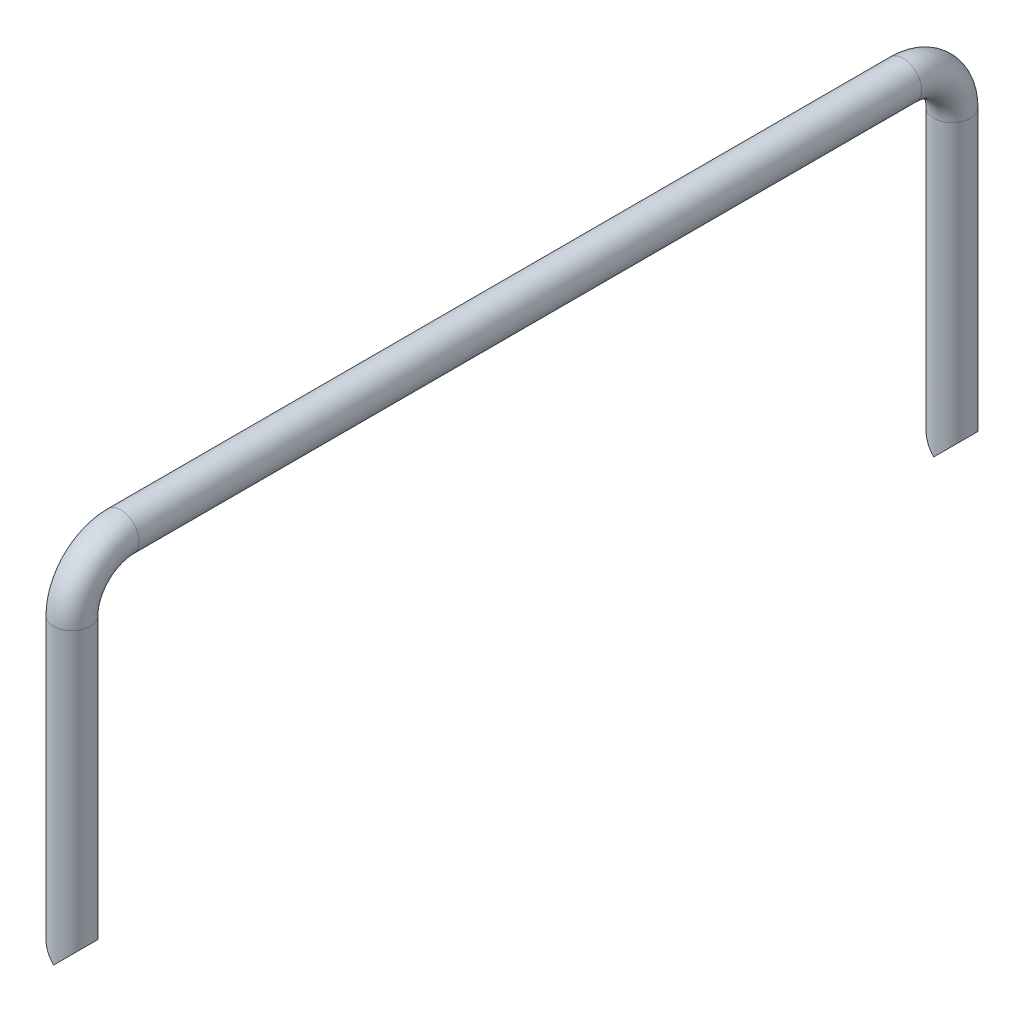
ISO-10303-21;
HEADER;
FILE_DESCRIPTION(('STEP AP214'),'2;1');
FILE_NAME('part.step','',(''),(''),'','','');
FILE_SCHEMA(('AUTOMOTIVE_DESIGN { 1 0 10303 214 1 1 1 1 }'));
ENDSEC;
DATA;
#1=APPLICATION_CONTEXT('core data for automotive mechanical design processes');
#2=APPLICATION_PROTOCOL_DEFINITION('international standard','automotive_design',2000,#1);
#3=PRODUCT_CONTEXT('',#1,'mechanical');
#4=PRODUCT('Part','Part','',(#3));
#5=PRODUCT_RELATED_PRODUCT_CATEGORY('part','',(#4));
#6=PRODUCT_DEFINITION_FORMATION('','',#4);
#7=PRODUCT_DEFINITION_CONTEXT('part definition',#1,'design');
#8=PRODUCT_DEFINITION('design','',#6,#7);
#9=PRODUCT_DEFINITION_SHAPE('','',#8);
#10=(LENGTH_UNIT() NAMED_UNIT(*) SI_UNIT(.MILLI.,.METRE.));
#11=(NAMED_UNIT(*) PLANE_ANGLE_UNIT() SI_UNIT($,.RADIAN.));
#12=(NAMED_UNIT(*) SI_UNIT($,.STERADIAN.) SOLID_ANGLE_UNIT());
#13=UNCERTAINTY_MEASURE_WITH_UNIT(LENGTH_MEASURE(1.E-05),#10,'distance_accuracy_value','');
#14=(GEOMETRIC_REPRESENTATION_CONTEXT(3) GLOBAL_UNCERTAINTY_ASSIGNED_CONTEXT((#13)) GLOBAL_UNIT_ASSIGNED_CONTEXT((#10,
#11,#12)) REPRESENTATION_CONTEXT('',''));
#15=CARTESIAN_POINT('',(0.,0.,0.));
#16=DIRECTION('',(0.,0.,1.));
#17=DIRECTION('',(1.,0.,0.));
#18=AXIS2_PLACEMENT_3D('',#15,#16,#17);
#19=CARTESIAN_POINT('',(0.,-228.6,-228.6));
#20=DIRECTION('',(0.,1.,0.));
#21=DIRECTION('',(0.,0.,1.));
#22=AXIS2_PLACEMENT_3D('',#19,#20,#21);
#23=CYLINDRICAL_SURFACE('',#22,9.525);
#24=CARTESIAN_POINT('',(0.,-76.2,-228.6));
#25=DIRECTION('',(0.,-1.,0.));
#26=DIRECTION('',(0.,0.,-1.));
#27=AXIS2_PLACEMENT_3D('',#24,#25,#26);
#28=CIRCLE('',#27,9.525);
#29=CARTESIAN_POINT('',(0.,-76.2,-238.125));
#30=VERTEX_POINT('',#29);
#31=EDGE_CURVE('E73',#30,#30,#28,.T.);
#32=ORIENTED_EDGE('',*,*,#31,.T.);
#33=EDGE_LOOP('',(#32));
#34=FACE_BOUND('',#33,.T.);
#35=CARTESIAN_POINT('',(0.,-228.6,-228.6));
#36=DIRECTION('',(-0.707106781186547,0.707106781186547,0.));
#37=DIRECTION('',(0.707106781186547,0.707106781186547,0.));
#38=AXIS2_PLACEMENT_3D('',#35,#36,#37);
#39=ELLIPSE('',#38,13.4703841816037,9.525);
#40=CARTESIAN_POINT('',(0.,-228.6,-219.075));
#41=VERTEX_POINT('',#40);
#42=CARTESIAN_POINT('',(0.,-228.6,-238.125));
#43=VERTEX_POINT('',#42);
#44=EDGE_CURVE('E41',#41,#43,#39,.T.);
#45=ORIENTED_EDGE('',*,*,#44,.T.);
#46=CARTESIAN_POINT('',(0.,-228.6,-228.6));
#47=DIRECTION('',(0.707106781186547,0.707106781186547,0.));
#48=DIRECTION('',(-0.707106781186547,0.707106781186547,0.));
#49=AXIS2_PLACEMENT_3D('',#46,#47,#48);
#50=ELLIPSE('',#49,13.4703841816037,9.525);
#51=EDGE_CURVE('E11',#43,#41,#50,.T.);
#52=ORIENTED_EDGE('',*,*,#51,.T.);
#53=EDGE_LOOP('',(#45,#52));
#54=FACE_BOUND('',#53,.T.);
#55=ADVANCED_FACE('F33',(#34,#54),#23,.T.);
#56=CARTESIAN_POINT('',(0.,-76.2,-203.2));
#57=DIRECTION('',(1.,0.,0.));
#58=DIRECTION('',(0.,0.,-1.));
#59=AXIS2_PLACEMENT_3D('',#56,#57,#58);
#60=TOROIDAL_SURFACE('',#59,25.4,9.525);
#61=CARTESIAN_POINT('',(0.,-50.8,-203.2));
#62=DIRECTION('',(0.,0.,-1.));
#63=DIRECTION('',(0.,1.,0.));
#64=AXIS2_PLACEMENT_3D('',#61,#62,#63);
#65=CIRCLE('',#64,9.525);
#66=CARTESIAN_POINT('',(0.,-41.275,-203.2));
#67=VERTEX_POINT('',#66);
#68=EDGE_CURVE('E70',#67,#67,#65,.T.);
#69=CARTESIAN_POINT('',(0.,-76.2,-203.2));
#70=DIRECTION('',(1.,0.,0.));
#71=DIRECTION('',(0.,0.,-1.));
#72=AXIS2_PLACEMENT_3D('',#69,#70,#71);
#73=CIRCLE('',#72,34.925);
#74=EDGE_CURVE('',#30,#67,#73,.T.);
#75=ORIENTED_EDGE('',*,*,#31,.F.);
#76=ORIENTED_EDGE('',*,*,#68,.T.);
#77=ORIENTED_EDGE('',*,*,#74,.T.);
#78=ORIENTED_EDGE('',*,*,#74,.F.);
#79=EDGE_LOOP('',(#75,#77,#76,#78));
#80=FACE_BOUND('',#79,.T.);
#81=ADVANCED_FACE('F126',(#80),#60,.T.);
#82=CARTESIAN_POINT('',(0.,-50.8,-203.2));
#83=DIRECTION('',(0.,0.,1.));
#84=DIRECTION('',(0.,-1.,0.));
#85=AXIS2_PLACEMENT_3D('',#82,#83,#84);
#86=CYLINDRICAL_SURFACE('',#85,9.525);
#87=CARTESIAN_POINT('',(0.,-50.8,203.2));
#88=DIRECTION('',(0.,0.,-1.));
#89=DIRECTION('',(0.,1.,0.));
#90=AXIS2_PLACEMENT_3D('',#87,#88,#89);
#91=CIRCLE('',#90,9.525);
#92=CARTESIAN_POINT('',(0.,-41.275,203.2));
#93=VERTEX_POINT('',#92);
#94=EDGE_CURVE('E67',#93,#93,#91,.T.);
#95=ORIENTED_EDGE('',*,*,#94,.T.);
#96=EDGE_LOOP('',(#95));
#97=FACE_BOUND('',#96,.T.);
#98=ORIENTED_EDGE('',*,*,#68,.F.);
#99=EDGE_LOOP('',(#98));
#100=FACE_BOUND('',#99,.T.);
#101=ADVANCED_FACE('F121',(#97,#100),#86,.T.);
#102=CARTESIAN_POINT('',(0.,-76.2,203.2));
#103=DIRECTION('',(1.,0.,0.));
#104=DIRECTION('',(0.,0.,-1.));
#105=AXIS2_PLACEMENT_3D('',#102,#103,#104);
#106=TOROIDAL_SURFACE('',#105,25.4,9.525);
#107=CARTESIAN_POINT('',(0.,-76.2000000000002,228.6));
#108=DIRECTION('',(0.,1.,0.));
#109=DIRECTION('',(0.,0.,1.));
#110=AXIS2_PLACEMENT_3D('',#107,#108,#109);
#111=CIRCLE('',#110,9.525);
#112=CARTESIAN_POINT('',(0.,-76.2000000000002,238.125));
#113=VERTEX_POINT('',#112);
#114=EDGE_CURVE('E60',#113,#113,#111,.T.);
#115=CARTESIAN_POINT('',(0.,-76.2,203.2));
#116=DIRECTION('',(1.,0.,0.));
#117=DIRECTION('',(0.,0.,-1.));
#118=AXIS2_PLACEMENT_3D('',#115,#116,#117);
#119=CIRCLE('',#118,34.925);
#120=EDGE_CURVE('',#93,#113,#119,.T.);
#121=ORIENTED_EDGE('',*,*,#94,.F.);
#122=ORIENTED_EDGE('',*,*,#114,.T.);
#123=ORIENTED_EDGE('',*,*,#120,.T.);
#124=ORIENTED_EDGE('',*,*,#120,.F.);
#125=EDGE_LOOP('',(#121,#123,#122,#124));
#126=FACE_BOUND('',#125,.T.);
#127=ADVANCED_FACE('F114',(#126),#106,.T.);
#128=CARTESIAN_POINT('',(0.,-76.2,228.6));
#129=DIRECTION('',(0.,-1.,0.));
#130=DIRECTION('',(0.,0.,-1.));
#131=AXIS2_PLACEMENT_3D('',#128,#129,#130);
#132=CYLINDRICAL_SURFACE('',#131,9.525);
#133=CARTESIAN_POINT('',(0.,-228.6,228.6));
#134=DIRECTION('',(-0.707106781186547,-0.707106781186547,0.));
#135=DIRECTION('',(0.707106781186547,-0.707106781186547,0.));
#136=AXIS2_PLACEMENT_3D('',#133,#134,#135);
#137=ELLIPSE('',#136,13.4703841816037,9.525);
#138=CARTESIAN_POINT('',(0.,-228.6,219.075));
#139=VERTEX_POINT('',#138);
#140=CARTESIAN_POINT('',(0.,-228.6,238.125));
#141=VERTEX_POINT('',#140);
#142=EDGE_CURVE('E57',#139,#141,#137,.F.);
#143=ORIENTED_EDGE('',*,*,#142,.T.);
#144=CARTESIAN_POINT('',(0.,-228.6,228.6));
#145=DIRECTION('',(0.707106781186547,-0.707106781186547,0.));
#146=DIRECTION('',(-0.707106781186547,-0.707106781186547,0.));
#147=AXIS2_PLACEMENT_3D('',#144,#145,#146);
#148=ELLIPSE('',#147,13.4703841816037,9.525);
#149=EDGE_CURVE('E52',#141,#139,#148,.F.);
#150=ORIENTED_EDGE('',*,*,#149,.T.);
#151=EDGE_LOOP('',(#143,#150));
#152=FACE_BOUND('',#151,.T.);
#153=ORIENTED_EDGE('',*,*,#114,.F.);
#154=EDGE_LOOP('',(#153));
#155=FACE_BOUND('',#154,.T.);
#156=ADVANCED_FACE('F35',(#152,#155),#132,.T.);
#157=CARTESIAN_POINT('',(-161.925,-228.6,228.6));
#158=DIRECTION('',(1.,0.,0.));
#159=DIRECTION('',(0.,0.,-1.));
#160=AXIS2_PLACEMENT_3D('',#157,#158,#159);
#161=CYLINDRICAL_SURFACE('',#160,9.52499999999999);
#162=CARTESIAN_POINT('',(-8.255,-219.075,228.6));
#163=CARTESIAN_POINT('',(-8.2549991309736,-219.07500085137,228.793749133983));
#164=CARTESIAN_POINT('',(-8.24816678082066,-219.080923976125,228.987510695369));
#165=CARTESIAN_POINT('',(-8.22096978778911,-219.104480069302,229.373368577547));
#166=CARTESIAN_POINT('',(-8.20060395213657,-219.122114069863,229.565464750048));
#167=CARTESIAN_POINT('',(-8.14671669800962,-219.168700531082,229.946505754108));
#168=CARTESIAN_POINT('',(-8.11318830370018,-219.197658993398,230.135448859172));
#169=CARTESIAN_POINT('',(-8.03357968300137,-219.26626573945,230.508674190852));
#170=CARTESIAN_POINT('',(-7.98749944772571,-219.305914030754,230.692956414168));
#171=CARTESIAN_POINT('',(-7.883876820132,-219.394816129542,231.054517254249));
#172=CARTESIAN_POINT('',(-7.82641012090953,-219.444006461934,231.231833318214));
#173=CARTESIAN_POINT('',(-7.70062697305925,-219.551288626491,231.579870442183));
#174=CARTESIAN_POINT('',(-7.63230577878791,-219.609384351749,231.75058857676));
#175=CARTESIAN_POINT('',(-7.48568628536984,-219.733513866231,232.084651882336));
#176=CARTESIAN_POINT('',(-7.40738906925856,-219.799546793716,232.247997851083));
#177=CARTESIAN_POINT('',(-7.24162523096908,-219.938608516535,232.566887574014));
#178=CARTESIAN_POINT('',(-7.15415660082004,-220.011638843562,232.722429608553));
#179=CARTESIAN_POINT('',(-6.93563606350435,-220.192942230831,233.083524955091));
#180=CARTESIAN_POINT('',(-6.80073731523925,-220.303987372303,233.285372428281));
#181=CARTESIAN_POINT('',(-6.51661799509543,-220.535256151997,233.673118621409));
#182=CARTESIAN_POINT('',(-6.36739233738683,-220.655483046478,233.859011633082));
#183=CARTESIAN_POINT('',(-6.05568545559863,-220.903057246966,234.215142976407));
#184=CARTESIAN_POINT('',(-5.8931737790294,-221.03042068778,234.385343327033));
#185=CARTESIAN_POINT('',(-5.55624676339451,-221.289672364822,234.709650125725));
#186=CARTESIAN_POINT('',(-5.38183301047557,-221.421559996968,234.863758711384));
#187=CARTESIAN_POINT('',(-5.0178870415543,-221.690268739031,235.159109417956));
#188=CARTESIAN_POINT('',(-4.82811425764209,-221.827135289796,235.300013389537));
#189=CARTESIAN_POINT('',(-4.4368295491694,-222.100277029826,235.565304618899));
#190=CARTESIAN_POINT('',(-4.23531384968984,-222.236552013629,235.689686522828));
#191=CARTESIAN_POINT('',(-3.82063329870358,-222.504688635106,235.921483300549));
#192=CARTESIAN_POINT('',(-3.60749309828619,-222.636558723786,236.028932333052));
#193=CARTESIAN_POINT('',(-3.16843181970335,-222.891442369474,236.226529850752));
#194=CARTESIAN_POINT('',(-2.9425210294585,-223.01446287908,236.316692012068));
#195=CARTESIAN_POINT('',(-2.46681442998317,-223.250125579428,236.482003581481));
#196=CARTESIAN_POINT('',(-2.21641466916661,-223.362117857019,236.556366663297));
#197=CARTESIAN_POINT('',(-1.69963891728645,-223.558880568049,236.682480743163));
#198=CARTESIAN_POINT('',(-1.4332984675925,-223.643709065653,236.734280059203));
#199=CARTESIAN_POINT('',(-1.04394084534308,-223.736097566616,236.789573262637));
#200=CARTESIAN_POINT('',(-0.926240140688876,-223.760081572859,236.803739392844));
#201=CARTESIAN_POINT('',(-0.688990887447079,-223.799826557136,236.827058784652));
#202=CARTESIAN_POINT('',(-0.569443240153976,-223.815591423194,236.836214416545));
#203=CARTESIAN_POINT('',(-0.329320339337318,-223.838195926769,236.849304199387));
#204=CARTESIAN_POINT('',(-0.208746073071931,-223.845043337139,236.853242897697));
#205=CARTESIAN_POINT('',(0.0326338460709946,-223.849515298126,236.855817780715));
#206=CARTESIAN_POINT('',(0.153439501382238,-223.847139751201,236.854453909342));
#207=CARTESIAN_POINT('',(0.39416554602283,-223.833287188579,236.846462088077));
#208=CARTESIAN_POINT('',(0.514086996622013,-223.821823920942,236.839842089721));
#209=CARTESIAN_POINT('',(0.752426471254575,-223.790347526087,236.821507905245));
#210=CARTESIAN_POINT('',(0.870843834060207,-223.770330763999,236.809791553356));
#211=CARTESIAN_POINT('',(1.22310602414191,-223.698589799333,236.767308180379));
#212=CARTESIAN_POINT('',(1.45376292887392,-223.635188530354,236.72921400914));
#213=CARTESIAN_POINT('',(1.86370727584935,-223.498694955178,236.644099327065));
#214=CARTESIAN_POINT('',(2.04487996617529,-223.429283916365,236.59983803945));
#215=CARTESIAN_POINT('',(2.39953345699066,-223.279042683176,236.500705639612));
#216=CARTESIAN_POINT('',(2.5730088511059,-223.198204624502,236.445827210796));
#217=CARTESIAN_POINT('',(2.91302040075866,-223.028240047895,236.32605718343));
#218=CARTESIAN_POINT('',(3.0795304006909,-222.939085754094,236.261131514579));
#219=CARTESIAN_POINT('',(3.40543837179346,-222.755384272125,236.121927466596));
#220=CARTESIAN_POINT('',(3.56483714546791,-222.660837695236,236.047650146436));
#221=CARTESIAN_POINT('',(3.95950975045322,-222.417533604388,235.848366005193));
#222=CARTESIAN_POINT('',(4.19036061822684,-222.266534072351,235.717295478695));
#223=CARTESIAN_POINT('',(4.63747538270595,-221.962225101465,235.434385836415));
#224=CARTESIAN_POINT('',(4.85373191319789,-221.808914543225,235.282536348192));
#225=CARTESIAN_POINT('',(5.27132385376008,-221.504431641632,234.958297438884));
#226=CARTESIAN_POINT('',(5.47267772045491,-221.353256847606,234.785934138232));
#227=CARTESIAN_POINT('',(5.8599383863932,-221.056523823392,234.420393868889));
#228=CARTESIAN_POINT('',(6.04585204532014,-220.910963114576,234.227226231587));
#229=CARTESIAN_POINT('',(6.35820893639358,-220.662698797748,233.86880872899));
#230=CARTESIAN_POINT('',(6.48822041734567,-220.558090176679,233.707976401375));
#231=CARTESIAN_POINT('',(6.73756594349465,-220.355601927927,233.374263989522));
#232=CARTESIAN_POINT('',(6.85690232909822,-220.257720826399,233.201386560908));
#233=CARTESIAN_POINT('',(7.08366003651117,-220.070359334607,232.843997602673));
#234=CARTESIAN_POINT('',(7.19109566852849,-219.980868875253,232.659500473618));
#235=CARTESIAN_POINT('',(7.39290924178345,-219.81178786899,232.279162252312));
#236=CARTESIAN_POINT('',(7.48728961825412,-219.732195476047,232.083323285382));
#237=CARTESIAN_POINT('',(7.64607452720217,-219.597688658435,231.716896785423));
#238=CARTESIAN_POINT('',(7.71282515872357,-219.540902606584,231.548010254906));
#239=CARTESIAN_POINT('',(7.83572387058532,-219.436041203049,231.203811346086));
#240=CARTESIAN_POINT('',(7.89187416542449,-219.387964032091,231.028500319075));
#241=CARTESIAN_POINT('',(7.99277926561638,-219.30137378059,230.672375751217));
#242=CARTESIAN_POINT('',(8.03753797954922,-219.262857419736,230.491564121593));
#243=CARTESIAN_POINT('',(8.11497986008862,-219.19611185728,230.125491254042));
#244=CARTESIAN_POINT('',(8.14766289484144,-219.167882768005,229.940229967554));
#245=CARTESIAN_POINT('',(8.20051181828126,-219.122193476377,229.565693777288));
#246=CARTESIAN_POINT('',(8.22061737363726,-219.104785183164,229.376403964306));
#247=CARTESIAN_POINT('',(8.24768993736896,-219.081337103709,228.99618049332));
#248=CARTESIAN_POINT('',(8.25465691616095,-219.075297343066,228.805246831617));
#249=CARTESIAN_POINT('',(8.2553183095402,-219.07472412799,228.423354685229));
#250=CARTESIAN_POINT('',(8.24901373573472,-219.080189796571,228.232396203547));
#251=CARTESIAN_POINT('',(8.22325492565545,-219.102501380858,227.852047815249));
#252=CARTESIAN_POINT('',(8.20380124943698,-219.11934681187,227.662657842174));
#253=CARTESIAN_POINT('',(8.15408122776019,-219.162336192805,227.301276987326));
#254=CARTESIAN_POINT('',(8.12475103759837,-219.187674409474,227.129059372116));
#255=CARTESIAN_POINT('',(8.05561104968293,-219.247291157423,226.788261428203));
#256=CARTESIAN_POINT('',(8.01579775061752,-219.28157267569,226.619682335142));
#257=CARTESIAN_POINT('',(7.92625943872894,-219.358481542436,226.287193793368));
#258=CARTESIAN_POINT('',(7.87653736329025,-219.401106417521,226.123282977198));
#259=CARTESIAN_POINT('',(7.76777500026875,-219.494060632431,225.800772493091));
#260=CARTESIAN_POINT('',(7.70873123855652,-219.544392844517,225.642174832152));
#261=CARTESIAN_POINT('',(7.57702515132396,-219.656253247045,225.318760887249));
#262=CARTESIAN_POINT('',(7.50365911320601,-219.718349023612,225.154427355193));
#263=CARTESIAN_POINT('',(7.34765599089069,-219.84974919785,224.833184711284));
#264=CARTESIAN_POINT('',(7.26501525757018,-219.919056432078,224.676278556494));
#265=CARTESIAN_POINT('',(7.00428589271637,-220.136469748638,224.217216319907));
#266=CARTESIAN_POINT('',(6.81336884998677,-220.294085643406,223.926665178198));
#267=CARTESIAN_POINT('',(6.45283278047186,-220.586795384044,223.445068693598));
#268=CARTESIAN_POINT('',(6.28928934942981,-220.718072006197,223.24698711938));
#269=CARTESIAN_POINT('',(5.94739409173008,-220.988096265142,222.869526138686));
#270=CARTESIAN_POINT('',(5.76904131931236,-221.126844378882,222.690147928305));
#271=CARTESIAN_POINT('',(5.39827838667593,-221.409205633139,222.349627109202));
#272=CARTESIAN_POINT('',(5.20583488153903,-221.552829852161,222.188530218004));
#273=CARTESIAN_POINT('',(4.80788440247815,-221.841483857342,221.884949827782));
#274=CARTESIAN_POINT('',(4.60238145150825,-221.986513199098,221.742460637592));
#275=CARTESIAN_POINT('',(4.22170022153732,-222.244840743108,221.503388496548));
#276=CARTESIAN_POINT('',(4.0489403447749,-222.358549640076,221.403382572897));
#277=CARTESIAN_POINT('',(3.6947062081715,-222.582312464771,221.215258160118));
#278=CARTESIAN_POINT('',(3.51323035552953,-222.692365718185,221.127141855052));
#279=CARTESIAN_POINT('',(3.14146809775945,-222.905590868976,220.963421066369));
#280=CARTESIAN_POINT('',(2.95120539019993,-223.00877963104,220.887785187886));
#281=CARTESIAN_POINT('',(2.56091153040395,-223.204599732918,220.749545792574));
#282=CARTESIAN_POINT('',(2.3608873997497,-223.297238506192,220.686933073675));
#283=CARTESIAN_POINT('',(1.91710109618571,-223.480539028389,220.566906121685));
#284=CARTESIAN_POINT('',(1.67147843973416,-223.568486554437,220.511947549068));
#285=CARTESIAN_POINT('',(1.29366079541495,-223.676624086336,220.445995162006));
#286=CARTESIAN_POINT('',(1.16625357807994,-223.708691291353,220.426766608547));
#287=CARTESIAN_POINT('',(0.908760812182196,-223.76361192475,220.394148700816));
#288=CARTESIAN_POINT('',(0.778676743118099,-223.786470306333,220.380756207151));
#289=CARTESIAN_POINT('',(0.515053294315989,-223.82206810894,220.360010368661));
#290=CARTESIAN_POINT('',(0.381491235325665,-223.834684394664,220.35273047777));
#291=CARTESIAN_POINT('',(0.113582080058723,-223.848619874186,220.344693892553));
#292=CARTESIAN_POINT('',(-0.0207649568470333,-223.849939911573,220.34393671112));
#293=CARTESIAN_POINT('',(-0.289034938598484,-223.841202324924,220.348970145875));
#294=CARTESIAN_POINT('',(-0.422957602740182,-223.831138307579,220.354764441386));
#295=CARTESIAN_POINT('',(-0.689111683742148,-223.800209848149,220.372731137426));
#296=CARTESIAN_POINT('',(-0.82134281772943,-223.779343623203,220.384904590814));
#297=CARTESIAN_POINT('',(-1.10454643006355,-223.723697580562,220.417793404478));
#298=CARTESIAN_POINT('',(-1.25505528789718,-223.687202723969,220.439578635414));
#299=CARTESIAN_POINT('',(-1.55170325268703,-223.603191155665,220.490749992828));
#300=CARTESIAN_POINT('',(-1.69783869586882,-223.555665479551,220.520142303591));
#301=CARTESIAN_POINT('',(-1.98570912314554,-223.451644772577,220.586021121705));
#302=CARTESIAN_POINT('',(-2.12742964309165,-223.39512334772,220.622528578341));
#303=CARTESIAN_POINT('',(-2.4059581107911,-223.275204077361,220.702066057463));
#304=CARTESIAN_POINT('',(-2.54276715365901,-223.211807777588,220.745094614622));
#305=CARTESIAN_POINT('',(-2.90759118568056,-223.032749866028,220.870168950102));
#306=CARTESIAN_POINT('',(-3.13110425848444,-222.912045295214,220.958163433105));
#307=CARTESIAN_POINT('',(-3.56559758605924,-222.661768069578,221.150968983281));
#308=CARTESIAN_POINT('',(-3.77656911147846,-222.532189369989,221.255791579878));
#309=CARTESIAN_POINT('',(-4.18706965610038,-222.268538777804,221.481824189893));
#310=CARTESIAN_POINT('',(-4.38658228698,-222.134460864055,221.603056880467));
#311=CARTESIAN_POINT('',(-4.77419601105203,-221.865453567415,221.861578509005));
#312=CARTESIAN_POINT('',(-4.96229989336762,-221.730524401609,221.998863498402));
#313=CARTESIAN_POINT('',(-5.33822587447612,-221.454370347392,222.298444095809));
#314=CARTESIAN_POINT('',(-5.52532860119198,-221.313264475866,222.461755311956));
#315=CARTESIAN_POINT('',(-5.88601693765023,-221.036105671408,222.806719513531));
#316=CARTESIAN_POINT('',(-6.05959990411037,-220.90005372929,222.988376069838));
#317=CARTESIAN_POINT('',(-6.39160103031026,-220.636140711227,223.369682424321));
#318=CARTESIAN_POINT('',(-6.55005185964252,-220.50826219629,223.569291566071));
#319=CARTESIAN_POINT('',(-6.85042540907248,-220.263250623786,223.98667872514));
#320=CARTESIAN_POINT('',(-6.99235568599345,-220.146112658529,224.204448356632));
#321=CARTESIAN_POINT('',(-7.21895608703126,-219.957591966555,224.591711433497));
#322=CARTESIAN_POINT('',(-7.30828007272977,-219.882805017896,224.756843154747));
#323=CARTESIAN_POINT('',(-7.47660654907036,-219.74120930788,225.095556720758));
#324=CARTESIAN_POINT('',(-7.55561158090455,-219.674398582611,225.269136470562));
#325=CARTESIAN_POINT('',(-7.70228991439694,-219.549896757306,225.623998853516));
#326=CARTESIAN_POINT('',(-7.76997311226876,-219.492197695421,225.805274584102));
#327=CARTESIAN_POINT('',(-7.8931183352214,-219.386917126928,226.174795693031));
#328=CARTESIAN_POINT('',(-7.94858170019485,-219.339334511082,226.363040304597));
#329=CARTESIAN_POINT('',(-8.039551741935,-219.261127906438,226.718653766488));
#330=CARTESIAN_POINT('',(-8.07676302214278,-219.229064178173,226.885271665007));
#331=CARTESIAN_POINT('',(-8.14097036810243,-219.173668033218,227.221958753979));
#332=CARTESIAN_POINT('',(-8.16796357789891,-219.150338057636,227.392028895362));
#333=CARTESIAN_POINT('',(-8.21131805296772,-219.112838905102,227.734511854833));
#334=CARTESIAN_POINT('',(-8.22768016098987,-219.09866900201,227.906924486121));
#335=CARTESIAN_POINT('',(-8.24951956226246,-219.079750865947,228.252888376113));
#336=CARTESIAN_POINT('',(-8.2550007784753,-219.074999237341,228.426439201805));
#337=CARTESIAN_POINT('',(-8.255,-219.075,228.6));
#338=B_SPLINE_CURVE_WITH_KNOTS('',3,(#162,#163,#164,#165,#166,#167,#168,#169,#170,#171,#172,
#173,#174,#175,#176,#177,#178,#179,#180,#181,#182,#183,#184,#185,#186,#187,#188,#189,#190,#191,
#192,#193,#194,#195,#196,#197,#198,#199,#200,#201,#202,#203,#204,#205,#206,#207,#208,#209,#210,
#211,#212,#213,#214,#215,#216,#217,#218,#219,#220,#221,#222,#223,#224,#225,#226,#227,#228,#229,
#230,#231,#232,#233,#234,#235,#236,#237,#238,#239,#240,#241,#242,#243,#244,#245,#246,#247,#248,
#249,#250,#251,#252,#253,#254,#255,#256,#257,#258,#259,#260,#261,#262,#263,#264,#265,#266,#267,
#268,#269,#270,#271,#272,#273,#274,#275,#276,#277,#278,#279,#280,#281,#282,#283,#284,#285,#286,
#287,#288,#289,#290,#291,#292,#293,#294,#295,#296,#297,#298,#299,#300,#301,#302,#303,#304,#305,
#306,#307,#308,#309,#310,#311,#312,#313,#314,#315,#316,#317,#318,#319,#320,#321,#322,#323,#324,
#325,#326,#327,#328,#329,#330,#331,#332,#333,#334,#335,#336,#337),.UNSPECIFIED.,.T.,.F.,(4,2,2,
2,2,2,2,2,2,2,2,2,2,2,2,2,2,2,2,2,2,2,2,2,2,2,2,2,2,2,2,2,2,2,2,2,2,2,2,2,2,2,2,2,2,2,2,2,2,2,2,
2,2,2,2,2,2,2,2,2,2,2,2,2,2,2,2,2,2,2,2,2,2,2,2,2,2,2,2,2,2,2,2,2,2,2,2,4),(0.,
0.581060302241176,1.16217182303355,1.74359173542285,2.32501205943971,2.90268969124198,
3.48062058537872,4.05848879048118,4.63648377810276,5.4362169542025,6.23623508026258,
7.03814127970881,7.83994081992863,8.65857780584573,9.47747942119566,10.2947073130675,
11.1112859813718,11.9620431912297,12.8109695269324,13.1734956172863,13.5358500604876,
13.8978884475343,14.2599306635728,14.6214262186982,14.9830755469357,15.7069631447091,
16.3031815010825,16.8998122025499,17.4985123074859,18.0971446771323,19.0121600805803,
19.927633918925,20.841954302152,21.7558662790183,22.450561462509,23.1451039659046,
23.8388020282263,24.5323705181271,25.1026275067059,25.6727652316905,26.2427070714556,
26.8126551342035,27.3853166471827,27.9579794496037,28.5305986031096,29.1031933687764,
29.6321866176356,30.1613567724987,30.6903702914557,31.2195814376323,31.7901536941553,
32.3609512342489,33.5023725912857,34.3667872613035,35.2312571774337,36.0978433977629,
36.9641639487797,37.6529096955541,38.341781789667,39.0288936791848,39.715518398605,
40.512573766315,40.9105237639805,41.3082594272077,41.7107088469781,42.1131282121322,
42.5157736890733,42.918485642225,43.38692566356,43.8557477127695,44.32597156752,
44.7960899166667,45.6013224389748,46.4071090223581,47.2140207141777,48.0207343366109,
48.8767355197429,49.732903643882,50.5871794481831,51.441062941544,52.0468024868875,
52.6523925776822,53.2574505352097,53.8624421156741,54.3830405578493,54.9037844002805,
55.4244869572119,55.9450017475653),.UNSPECIFIED.);
#339=CARTESIAN_POINT('',(-8.255,-219.075,228.6));
#340=VERTEX_POINT('',#339);
#341=EDGE_CURVE('E77',#340,#340,#338,.T.);
#342=ORIENTED_EDGE('',*,*,#341,.T.);
#343=EDGE_LOOP('',(#342));
#344=FACE_BOUND('',#343,.T.);
#345=ORIENTED_EDGE('',*,*,#142,.F.);
#346=ORIENTED_EDGE('',*,*,#149,.F.);
#347=EDGE_LOOP('',(#345,#346));
#348=FACE_BOUND('',#347,.T.);
#349=ADVANCED_FACE('F58',(#344,#348),#161,.F.);
#350=CARTESIAN_POINT('',(-161.925,-228.6,-228.6));
#351=DIRECTION('',(1.,0.,0.));
#352=DIRECTION('',(0.,0.,-1.));
#353=AXIS2_PLACEMENT_3D('',#350,#351,#352);
#354=CYLINDRICAL_SURFACE('',#353,9.52499999999999);
#355=CARTESIAN_POINT('',(8.255,-219.075,-228.6));
#356=CARTESIAN_POINT('',(8.2549991309736,-219.07500085137,-228.793749133983));
#357=CARTESIAN_POINT('',(8.24816678082066,-219.080923976125,-228.987510695369));
#358=CARTESIAN_POINT('',(8.22096978778911,-219.104480069302,-229.373368577547));
#359=CARTESIAN_POINT('',(8.20060395213657,-219.122114069863,-229.565464750048));
#360=CARTESIAN_POINT('',(8.14671669800962,-219.168700531082,-229.946505754108));
#361=CARTESIAN_POINT('',(8.11318830370018,-219.197658993398,-230.135448859172));
#362=CARTESIAN_POINT('',(8.03357968300137,-219.26626573945,-230.508674190852));
#363=CARTESIAN_POINT('',(7.98749944772571,-219.305914030754,-230.692956414168));
#364=CARTESIAN_POINT('',(7.883876820132,-219.394816129542,-231.054517254249));
#365=CARTESIAN_POINT('',(7.82641012090953,-219.444006461934,-231.231833318214));
#366=CARTESIAN_POINT('',(7.70062697305925,-219.551288626491,-231.579870442183));
#367=CARTESIAN_POINT('',(7.63230577878791,-219.609384351749,-231.75058857676));
#368=CARTESIAN_POINT('',(7.48568628536984,-219.733513866231,-232.084651882336));
#369=CARTESIAN_POINT('',(7.40738906925856,-219.799546793716,-232.247997851083));
#370=CARTESIAN_POINT('',(7.24162523096908,-219.938608516535,-232.566887574014));
#371=CARTESIAN_POINT('',(7.15415660082004,-220.011638843562,-232.722429608553));
#372=CARTESIAN_POINT('',(6.93563606350435,-220.192942230831,-233.083524955091));
#373=CARTESIAN_POINT('',(6.80073731523925,-220.303987372303,-233.285372428281));
#374=CARTESIAN_POINT('',(6.51661799509543,-220.535256151997,-233.673118621409));
#375=CARTESIAN_POINT('',(6.36739233738683,-220.655483046478,-233.859011633082));
#376=CARTESIAN_POINT('',(6.05568545559863,-220.903057246966,-234.215142976407));
#377=CARTESIAN_POINT('',(5.8931737790294,-221.03042068778,-234.385343327033));
#378=CARTESIAN_POINT('',(5.55624676339451,-221.289672364822,-234.709650125725));
#379=CARTESIAN_POINT('',(5.38183301047557,-221.421559996968,-234.863758711384));
#380=CARTESIAN_POINT('',(5.0178870415543,-221.690268739031,-235.159109417956));
#381=CARTESIAN_POINT('',(4.82811425764209,-221.827135289796,-235.300013389537));
#382=CARTESIAN_POINT('',(4.4368295491694,-222.100277029826,-235.565304618899));
#383=CARTESIAN_POINT('',(4.23531384968984,-222.236552013629,-235.689686522828));
#384=CARTESIAN_POINT('',(3.82063329870358,-222.504688635106,-235.921483300549));
#385=CARTESIAN_POINT('',(3.60749309828619,-222.636558723786,-236.028932333052));
#386=CARTESIAN_POINT('',(3.16843181970335,-222.891442369474,-236.226529850752));
#387=CARTESIAN_POINT('',(2.9425210294585,-223.01446287908,-236.316692012068));
#388=CARTESIAN_POINT('',(2.46681442998317,-223.250125579428,-236.482003581481));
#389=CARTESIAN_POINT('',(2.21641466916661,-223.362117857019,-236.556366663297));
#390=CARTESIAN_POINT('',(1.69963891728645,-223.558880568049,-236.682480743163));
#391=CARTESIAN_POINT('',(1.4332984675925,-223.643709065653,-236.734280059203));
#392=CARTESIAN_POINT('',(1.04394084534308,-223.736097566616,-236.789573262637));
#393=CARTESIAN_POINT('',(0.926240140688876,-223.760081572859,-236.803739392844));
#394=CARTESIAN_POINT('',(0.688990887447079,-223.799826557136,-236.827058784652));
#395=CARTESIAN_POINT('',(0.569443240153976,-223.815591423194,-236.836214416545));
#396=CARTESIAN_POINT('',(0.329320339337318,-223.838195926769,-236.849304199387));
#397=CARTESIAN_POINT('',(0.208746073071931,-223.845043337139,-236.853242897697));
#398=CARTESIAN_POINT('',(-0.0326338460709946,-223.849515298126,-236.855817780715));
#399=CARTESIAN_POINT('',(-0.153439501382238,-223.847139751201,-236.854453909342));
#400=CARTESIAN_POINT('',(-0.39416554602283,-223.833287188579,-236.846462088077));
#401=CARTESIAN_POINT('',(-0.514086996622013,-223.821823920942,-236.839842089721));
#402=CARTESIAN_POINT('',(-0.752426471254575,-223.790347526087,-236.821507905245));
#403=CARTESIAN_POINT('',(-0.870843834060207,-223.770330763999,-236.809791553356));
#404=CARTESIAN_POINT('',(-1.22310602414191,-223.698589799333,-236.767308180379));
#405=CARTESIAN_POINT('',(-1.45376292887392,-223.635188530354,-236.72921400914));
#406=CARTESIAN_POINT('',(-1.86370727584935,-223.498694955178,-236.644099327065));
#407=CARTESIAN_POINT('',(-2.04487996617529,-223.429283916365,-236.59983803945));
#408=CARTESIAN_POINT('',(-2.39953345699066,-223.279042683176,-236.500705639612));
#409=CARTESIAN_POINT('',(-2.5730088511059,-223.198204624502,-236.445827210796));
#410=CARTESIAN_POINT('',(-2.91302040075866,-223.028240047895,-236.32605718343));
#411=CARTESIAN_POINT('',(-3.0795304006909,-222.939085754094,-236.261131514579));
#412=CARTESIAN_POINT('',(-3.40543837179346,-222.755384272125,-236.121927466596));
#413=CARTESIAN_POINT('',(-3.56483714546791,-222.660837695236,-236.047650146436));
#414=CARTESIAN_POINT('',(-3.95950975045322,-222.417533604388,-235.848366005193));
#415=CARTESIAN_POINT('',(-4.19036061822684,-222.266534072351,-235.717295478695));
#416=CARTESIAN_POINT('',(-4.63747538270595,-221.962225101465,-235.434385836415));
#417=CARTESIAN_POINT('',(-4.85373191319789,-221.808914543225,-235.282536348192));
#418=CARTESIAN_POINT('',(-5.27132385376008,-221.504431641632,-234.958297438884));
#419=CARTESIAN_POINT('',(-5.47267772045491,-221.353256847606,-234.785934138232));
#420=CARTESIAN_POINT('',(-5.8599383863932,-221.056523823392,-234.420393868889));
#421=CARTESIAN_POINT('',(-6.04585204532014,-220.910963114576,-234.227226231587));
#422=CARTESIAN_POINT('',(-6.35820893639358,-220.662698797748,-233.86880872899));
#423=CARTESIAN_POINT('',(-6.48822041734567,-220.558090176679,-233.707976401375));
#424=CARTESIAN_POINT('',(-6.73756594349465,-220.355601927927,-233.374263989522));
#425=CARTESIAN_POINT('',(-6.85690232909822,-220.257720826399,-233.201386560908));
#426=CARTESIAN_POINT('',(-7.08366003651117,-220.070359334607,-232.843997602673));
#427=CARTESIAN_POINT('',(-7.19109566852849,-219.980868875253,-232.659500473618));
#428=CARTESIAN_POINT('',(-7.39290924178345,-219.81178786899,-232.279162252312));
#429=CARTESIAN_POINT('',(-7.48728961825412,-219.732195476047,-232.083323285382));
#430=CARTESIAN_POINT('',(-7.64607452720217,-219.597688658435,-231.716896785423));
#431=CARTESIAN_POINT('',(-7.71282515872357,-219.540902606584,-231.548010254906));
#432=CARTESIAN_POINT('',(-7.83572387058532,-219.436041203049,-231.203811346086));
#433=CARTESIAN_POINT('',(-7.89187416542449,-219.387964032091,-231.028500319075));
#434=CARTESIAN_POINT('',(-7.99277926561638,-219.30137378059,-230.672375751217));
#435=CARTESIAN_POINT('',(-8.03753797954922,-219.262857419736,-230.491564121593));
#436=CARTESIAN_POINT('',(-8.11497986008862,-219.19611185728,-230.125491254042));
#437=CARTESIAN_POINT('',(-8.14766289484144,-219.167882768005,-229.940229967554));
#438=CARTESIAN_POINT('',(-8.20051181828126,-219.122193476377,-229.565693777288));
#439=CARTESIAN_POINT('',(-8.22061737363726,-219.104785183164,-229.376403964306));
#440=CARTESIAN_POINT('',(-8.24768993736896,-219.081337103709,-228.99618049332));
#441=CARTESIAN_POINT('',(-8.25465691616095,-219.075297343066,-228.805246831617));
#442=CARTESIAN_POINT('',(-8.2553183095402,-219.07472412799,-228.423354685229));
#443=CARTESIAN_POINT('',(-8.24901373573472,-219.080189796571,-228.232396203547));
#444=CARTESIAN_POINT('',(-8.22325492565545,-219.102501380858,-227.852047815249));
#445=CARTESIAN_POINT('',(-8.20380124943698,-219.11934681187,-227.662657842174));
#446=CARTESIAN_POINT('',(-8.15408122776019,-219.162336192805,-227.301276987326));
#447=CARTESIAN_POINT('',(-8.12475103759837,-219.187674409474,-227.129059372116));
#448=CARTESIAN_POINT('',(-8.05561104968293,-219.247291157423,-226.788261428203));
#449=CARTESIAN_POINT('',(-8.01579775061752,-219.28157267569,-226.619682335142));
#450=CARTESIAN_POINT('',(-7.92625943872894,-219.358481542436,-226.287193793368));
#451=CARTESIAN_POINT('',(-7.87653736329025,-219.401106417521,-226.123282977198));
#452=CARTESIAN_POINT('',(-7.76777500026875,-219.494060632431,-225.800772493091));
#453=CARTESIAN_POINT('',(-7.70873123855652,-219.544392844517,-225.642174832152));
#454=CARTESIAN_POINT('',(-7.57702515132396,-219.656253247045,-225.318760887249));
#455=CARTESIAN_POINT('',(-7.50365911320601,-219.718349023612,-225.154427355193));
#456=CARTESIAN_POINT('',(-7.34765599089069,-219.84974919785,-224.833184711284));
#457=CARTESIAN_POINT('',(-7.26501525757018,-219.919056432078,-224.676278556494));
#458=CARTESIAN_POINT('',(-7.00428589271637,-220.136469748638,-224.217216319907));
#459=CARTESIAN_POINT('',(-6.81336884998677,-220.294085643406,-223.926665178198));
#460=CARTESIAN_POINT('',(-6.45283278047186,-220.586795384044,-223.445068693598));
#461=CARTESIAN_POINT('',(-6.28928934942981,-220.718072006197,-223.24698711938));
#462=CARTESIAN_POINT('',(-5.94739409173008,-220.988096265142,-222.869526138686));
#463=CARTESIAN_POINT('',(-5.76904131931236,-221.126844378882,-222.690147928305));
#464=CARTESIAN_POINT('',(-5.39827838667593,-221.409205633139,-222.349627109202));
#465=CARTESIAN_POINT('',(-5.20583488153903,-221.552829852161,-222.188530218004));
#466=CARTESIAN_POINT('',(-4.80788440247815,-221.841483857342,-221.884949827782));
#467=CARTESIAN_POINT('',(-4.60238145150825,-221.986513199098,-221.742460637592));
#468=CARTESIAN_POINT('',(-4.22170022153732,-222.244840743108,-221.503388496548));
#469=CARTESIAN_POINT('',(-4.0489403447749,-222.358549640076,-221.403382572897));
#470=CARTESIAN_POINT('',(-3.6947062081715,-222.582312464771,-221.215258160118));
#471=CARTESIAN_POINT('',(-3.51323035552953,-222.692365718185,-221.127141855052));
#472=CARTESIAN_POINT('',(-3.14146809775945,-222.905590868976,-220.963421066369));
#473=CARTESIAN_POINT('',(-2.95120539019993,-223.00877963104,-220.887785187886));
#474=CARTESIAN_POINT('',(-2.56091153040395,-223.204599732918,-220.749545792574));
#475=CARTESIAN_POINT('',(-2.3608873997497,-223.297238506192,-220.686933073675));
#476=CARTESIAN_POINT('',(-1.91710109618571,-223.480539028389,-220.566906121685));
#477=CARTESIAN_POINT('',(-1.67147843973416,-223.568486554437,-220.511947549068));
#478=CARTESIAN_POINT('',(-1.29366079541495,-223.676624086336,-220.445995162006));
#479=CARTESIAN_POINT('',(-1.16625357807994,-223.708691291353,-220.426766608547));
#480=CARTESIAN_POINT('',(-0.908760812182196,-223.76361192475,-220.394148700816));
#481=CARTESIAN_POINT('',(-0.778676743118099,-223.786470306333,-220.380756207151));
#482=CARTESIAN_POINT('',(-0.515053294315989,-223.82206810894,-220.360010368661));
#483=CARTESIAN_POINT('',(-0.381491235325665,-223.834684394664,-220.35273047777));
#484=CARTESIAN_POINT('',(-0.113582080058723,-223.848619874186,-220.344693892553));
#485=CARTESIAN_POINT('',(0.0207649568470333,-223.849939911573,-220.34393671112));
#486=CARTESIAN_POINT('',(0.289034938598484,-223.841202324924,-220.348970145875));
#487=CARTESIAN_POINT('',(0.422957602740182,-223.831138307579,-220.354764441386));
#488=CARTESIAN_POINT('',(0.689111683742148,-223.800209848149,-220.372731137426));
#489=CARTESIAN_POINT('',(0.82134281772943,-223.779343623203,-220.384904590814));
#490=CARTESIAN_POINT('',(1.10454643006355,-223.723697580562,-220.417793404478));
#491=CARTESIAN_POINT('',(1.25505528789718,-223.687202723969,-220.439578635414));
#492=CARTESIAN_POINT('',(1.55170325268703,-223.603191155665,-220.490749992828));
#493=CARTESIAN_POINT('',(1.69783869586882,-223.555665479551,-220.520142303591));
#494=CARTESIAN_POINT('',(1.98570912314554,-223.451644772577,-220.586021121705));
#495=CARTESIAN_POINT('',(2.12742964309165,-223.39512334772,-220.622528578341));
#496=CARTESIAN_POINT('',(2.4059581107911,-223.275204077361,-220.702066057463));
#497=CARTESIAN_POINT('',(2.54276715365901,-223.211807777588,-220.745094614622));
#498=CARTESIAN_POINT('',(2.90759118568056,-223.032749866028,-220.870168950102));
#499=CARTESIAN_POINT('',(3.13110425848444,-222.912045295214,-220.958163433105));
#500=CARTESIAN_POINT('',(3.56559758605924,-222.661768069578,-221.150968983281));
#501=CARTESIAN_POINT('',(3.77656911147846,-222.532189369989,-221.255791579878));
#502=CARTESIAN_POINT('',(4.18706965610038,-222.268538777804,-221.481824189893));
#503=CARTESIAN_POINT('',(4.38658228698,-222.134460864055,-221.603056880467));
#504=CARTESIAN_POINT('',(4.77419601105203,-221.865453567415,-221.861578509005));
#505=CARTESIAN_POINT('',(4.96229989336762,-221.730524401609,-221.998863498402));
#506=CARTESIAN_POINT('',(5.33822587447612,-221.454370347392,-222.298444095809));
#507=CARTESIAN_POINT('',(5.52532860119198,-221.313264475866,-222.461755311956));
#508=CARTESIAN_POINT('',(5.88601693765023,-221.036105671408,-222.806719513531));
#509=CARTESIAN_POINT('',(6.05959990411037,-220.90005372929,-222.988376069838));
#510=CARTESIAN_POINT('',(6.39160103031026,-220.636140711227,-223.369682424321));
#511=CARTESIAN_POINT('',(6.55005185964252,-220.50826219629,-223.569291566071));
#512=CARTESIAN_POINT('',(6.85042540907248,-220.263250623786,-223.98667872514));
#513=CARTESIAN_POINT('',(6.99235568599345,-220.146112658529,-224.204448356632));
#514=CARTESIAN_POINT('',(7.21895608703126,-219.957591966555,-224.591711433497));
#515=CARTESIAN_POINT('',(7.30828007272977,-219.882805017896,-224.756843154747));
#516=CARTESIAN_POINT('',(7.47660654907036,-219.74120930788,-225.095556720758));
#517=CARTESIAN_POINT('',(7.55561158090455,-219.674398582611,-225.269136470562));
#518=CARTESIAN_POINT('',(7.70228991439694,-219.549896757306,-225.623998853516));
#519=CARTESIAN_POINT('',(7.76997311226876,-219.492197695421,-225.805274584102));
#520=CARTESIAN_POINT('',(7.8931183352214,-219.386917126928,-226.174795693031));
#521=CARTESIAN_POINT('',(7.94858170019485,-219.339334511082,-226.363040304597));
#522=CARTESIAN_POINT('',(8.039551741935,-219.261127906438,-226.718653766488));
#523=CARTESIAN_POINT('',(8.07676302214278,-219.229064178173,-226.885271665007));
#524=CARTESIAN_POINT('',(8.14097036810243,-219.173668033218,-227.221958753979));
#525=CARTESIAN_POINT('',(8.16796357789891,-219.150338057636,-227.392028895362));
#526=CARTESIAN_POINT('',(8.21131805296772,-219.112838905102,-227.734511854833));
#527=CARTESIAN_POINT('',(8.22768016098987,-219.09866900201,-227.906924486121));
#528=CARTESIAN_POINT('',(8.24951956226246,-219.079750865947,-228.252888376113));
#529=CARTESIAN_POINT('',(8.2550007784753,-219.074999237341,-228.426439201805));
#530=CARTESIAN_POINT('',(8.255,-219.075,-228.6));
#531=B_SPLINE_CURVE_WITH_KNOTS('',3,(#355,#356,#357,#358,#359,#360,#361,#362,#363,#364,#365,
#366,#367,#368,#369,#370,#371,#372,#373,#374,#375,#376,#377,#378,#379,#380,#381,#382,#383,#384,
#385,#386,#387,#388,#389,#390,#391,#392,#393,#394,#395,#396,#397,#398,#399,#400,#401,#402,#403,
#404,#405,#406,#407,#408,#409,#410,#411,#412,#413,#414,#415,#416,#417,#418,#419,#420,#421,#422,
#423,#424,#425,#426,#427,#428,#429,#430,#431,#432,#433,#434,#435,#436,#437,#438,#439,#440,#441,
#442,#443,#444,#445,#446,#447,#448,#449,#450,#451,#452,#453,#454,#455,#456,#457,#458,#459,#460,
#461,#462,#463,#464,#465,#466,#467,#468,#469,#470,#471,#472,#473,#474,#475,#476,#477,#478,#479,
#480,#481,#482,#483,#484,#485,#486,#487,#488,#489,#490,#491,#492,#493,#494,#495,#496,#497,#498,
#499,#500,#501,#502,#503,#504,#505,#506,#507,#508,#509,#510,#511,#512,#513,#514,#515,#516,#517,
#518,#519,#520,#521,#522,#523,#524,#525,#526,#527,#528,#529,#530),.UNSPECIFIED.,.T.,.F.,(4,2,2,
2,2,2,2,2,2,2,2,2,2,2,2,2,2,2,2,2,2,2,2,2,2,2,2,2,2,2,2,2,2,2,2,2,2,2,2,2,2,2,2,2,2,2,2,2,2,2,2,
2,2,2,2,2,2,2,2,2,2,2,2,2,2,2,2,2,2,2,2,2,2,2,2,2,2,2,2,2,2,2,2,2,2,2,2,4),(0.,
0.581060302241176,1.16217182303355,1.74359173542285,2.32501205943971,2.90268969124198,
3.48062058537872,4.05848879048118,4.63648377810276,5.4362169542025,6.23623508026258,
7.03814127970881,7.83994081992863,8.65857780584573,9.47747942119566,10.2947073130675,
11.1112859813718,11.9620431912297,12.8109695269324,13.1734956172863,13.5358500604876,
13.8978884475343,14.2599306635728,14.6214262186982,14.9830755469357,15.7069631447091,
16.3031815010825,16.8998122025499,17.4985123074859,18.0971446771323,19.0121600805803,
19.927633918925,20.841954302152,21.7558662790183,22.450561462509,23.1451039659046,
23.8388020282263,24.5323705181271,25.1026275067059,25.6727652316905,26.2427070714556,
26.8126551342035,27.3853166471827,27.9579794496037,28.5305986031096,29.1031933687764,
29.6321866176356,30.1613567724987,30.6903702914557,31.2195814376323,31.7901536941553,
32.3609512342489,33.5023725912857,34.3667872613035,35.2312571774337,36.0978433977629,
36.9641639487797,37.6529096955541,38.341781789667,39.0288936791848,39.715518398605,
40.512573766315,40.9105237639805,41.3082594272077,41.7107088469781,42.1131282121322,
42.5157736890733,42.918485642225,43.38692566356,43.8557477127695,44.32597156752,
44.7960899166667,45.6013224389748,46.4071090223581,47.2140207141777,48.0207343366109,
48.8767355197429,49.732903643882,50.5871794481831,51.441062941544,52.0468024868875,
52.6523925776822,53.2574505352097,53.8624421156741,54.3830405578493,54.9037844002805,
55.4244869572119,55.9450017475653),.UNSPECIFIED.);
#532=CARTESIAN_POINT('',(8.255,-219.075,-228.6));
#533=VERTEX_POINT('',#532);
#534=EDGE_CURVE('E76',#533,#533,#531,.T.);
#535=ORIENTED_EDGE('',*,*,#534,.T.);
#536=EDGE_LOOP('',(#535));
#537=FACE_BOUND('',#536,.T.);
#538=ORIENTED_EDGE('',*,*,#44,.F.);
#539=ORIENTED_EDGE('',*,*,#51,.F.);
#540=EDGE_LOOP('',(#538,#539));
#541=FACE_BOUND('',#540,.T.);
#542=ADVANCED_FACE('F101',(#537,#541),#354,.F.);
#543=CARTESIAN_POINT('',(0.,-228.6,-228.6));
#544=DIRECTION('',(0.,1.,0.));
#545=DIRECTION('',(0.,0.,1.));
#546=AXIS2_PLACEMENT_3D('',#543,#544,#545);
#547=CYLINDRICAL_SURFACE('',#546,8.255);
#548=CARTESIAN_POINT('',(0.,-76.2,-228.6));
#549=DIRECTION('',(0.,1.,0.));
#550=DIRECTION('',(0.,0.,1.));
#551=AXIS2_PLACEMENT_3D('',#548,#549,#550);
#552=CIRCLE('',#551,8.255);
#553=CARTESIAN_POINT('',(0.,-76.2,-236.855));
#554=VERTEX_POINT('',#553);
#555=EDGE_CURVE('E152',#554,#554,#552,.F.);
#556=ORIENTED_EDGE('',*,*,#555,.F.);
#557=EDGE_LOOP('',(#556));
#558=FACE_BOUND('',#557,.T.);
#559=ORIENTED_EDGE('',*,*,#534,.F.);
#560=EDGE_LOOP('',(#559));
#561=FACE_BOUND('',#560,.T.);
#562=ADVANCED_FACE('F97',(#558,#561),#547,.F.);
#563=CARTESIAN_POINT('',(0.,-76.2,-203.2));
#564=DIRECTION('',(1.,0.,0.));
#565=DIRECTION('',(0.,0.,-1.));
#566=AXIS2_PLACEMENT_3D('',#563,#564,#565);
#567=TOROIDAL_SURFACE('',#566,25.4,8.255);
#568=CARTESIAN_POINT('',(0.,-50.8,-203.2));
#569=DIRECTION('',(0.,0.,-1.));
#570=DIRECTION('',(0.,1.,0.));
#571=AXIS2_PLACEMENT_3D('',#568,#569,#570);
#572=CIRCLE('',#571,8.255);
#573=CARTESIAN_POINT('',(0.,-42.545,-203.2));
#574=VERTEX_POINT('',#573);
#575=EDGE_CURVE('E151',#574,#574,#572,.T.);
#576=CARTESIAN_POINT('',(0.,-76.2,-203.2));
#577=DIRECTION('',(1.,0.,0.));
#578=DIRECTION('',(0.,0.,-1.));
#579=AXIS2_PLACEMENT_3D('',#576,#577,#578);
#580=CIRCLE('',#579,33.655);
#581=EDGE_CURVE('',#554,#574,#580,.T.);
#582=ORIENTED_EDGE('',*,*,#555,.T.);
#583=ORIENTED_EDGE('',*,*,#575,.F.);
#584=ORIENTED_EDGE('',*,*,#581,.T.);
#585=ORIENTED_EDGE('',*,*,#581,.F.);
#586=EDGE_LOOP('',(#582,#584,#583,#585));
#587=FACE_BOUND('',#586,.T.);
#588=ADVANCED_FACE('F100',(#587),#567,.F.);
#589=CARTESIAN_POINT('',(0.,-50.8,-203.2));
#590=DIRECTION('',(0.,0.,1.));
#591=DIRECTION('',(0.,-1.,0.));
#592=AXIS2_PLACEMENT_3D('',#589,#590,#591);
#593=CYLINDRICAL_SURFACE('',#592,8.255);
#594=CARTESIAN_POINT('',(0.,-50.8000000000001,203.2));
#595=DIRECTION('',(0.,0.,1.));
#596=DIRECTION('',(0.,-1.,0.));
#597=AXIS2_PLACEMENT_3D('',#594,#595,#596);
#598=CIRCLE('',#597,8.255);
#599=CARTESIAN_POINT('',(0.,-42.545,203.2));
#600=VERTEX_POINT('',#599);
#601=EDGE_CURVE('E148',#600,#600,#598,.F.);
#602=ORIENTED_EDGE('',*,*,#601,.F.);
#603=EDGE_LOOP('',(#602));
#604=FACE_BOUND('',#603,.T.);
#605=ORIENTED_EDGE('',*,*,#575,.T.);
#606=EDGE_LOOP('',(#605));
#607=FACE_BOUND('',#606,.T.);
#608=ADVANCED_FACE('F107',(#604,#607),#593,.F.);
#609=CARTESIAN_POINT('',(0.,-76.2,203.2));
#610=DIRECTION('',(1.,0.,0.));
#611=DIRECTION('',(0.,0.,-1.));
#612=AXIS2_PLACEMENT_3D('',#609,#610,#611);
#613=TOROIDAL_SURFACE('',#612,25.4,8.255);
#614=CARTESIAN_POINT('',(0.,-76.2000000000002,228.6));
#615=DIRECTION('',(0.,1.,0.));
#616=DIRECTION('',(0.,0.,1.));
#617=AXIS2_PLACEMENT_3D('',#614,#615,#616);
#618=CIRCLE('',#617,8.255);
#619=CARTESIAN_POINT('',(0.,-76.2000000000003,236.855));
#620=VERTEX_POINT('',#619);
#621=EDGE_CURVE('E85',#620,#620,#618,.T.);
#622=CARTESIAN_POINT('',(0.,-76.2,203.2));
#623=DIRECTION('',(1.,0.,0.));
#624=DIRECTION('',(0.,0.,-1.));
#625=AXIS2_PLACEMENT_3D('',#622,#623,#624);
#626=CIRCLE('',#625,33.655);
#627=EDGE_CURVE('',#600,#620,#626,.T.);
#628=ORIENTED_EDGE('',*,*,#601,.T.);
#629=ORIENTED_EDGE('',*,*,#621,.F.);
#630=ORIENTED_EDGE('',*,*,#627,.T.);
#631=ORIENTED_EDGE('',*,*,#627,.F.);
#632=EDGE_LOOP('',(#628,#630,#629,#631));
#633=FACE_BOUND('',#632,.T.);
#634=ADVANCED_FACE('F137',(#633),#613,.F.);
#635=CARTESIAN_POINT('',(0.,-76.2,228.6));
#636=DIRECTION('',(0.,-1.,0.));
#637=DIRECTION('',(0.,0.,-1.));
#638=AXIS2_PLACEMENT_3D('',#635,#636,#637);
#639=CYLINDRICAL_SURFACE('',#638,8.255);
#640=ORIENTED_EDGE('',*,*,#341,.F.);
#641=EDGE_LOOP('',(#640));
#642=FACE_BOUND('',#641,.T.);
#643=ORIENTED_EDGE('',*,*,#621,.T.);
#644=EDGE_LOOP('',(#643));
#645=FACE_BOUND('',#644,.T.);
#646=ADVANCED_FACE('F92',(#642,#645),#639,.F.);
#647=CLOSED_SHELL('',(#55,#81,#101,#127,#156,#349,#542,#562,#588,#608,#634,#646));
#648=MANIFOLD_SOLID_BREP('B2',#647);
#649=ADVANCED_BREP_SHAPE_REPRESENTATION('',(#18,#648),#14);
#650=SHAPE_DEFINITION_REPRESENTATION(#9,#649);
ENDSEC;
END-ISO-10303-21;
